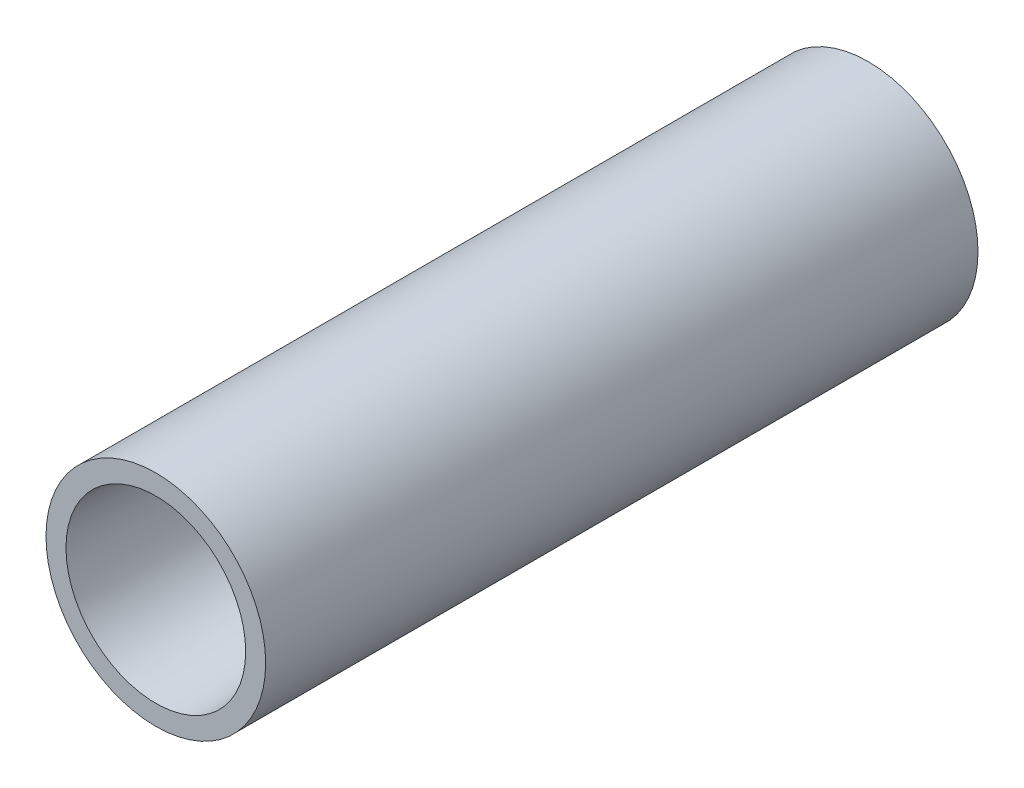
ISO-10303-21;
HEADER;
FILE_DESCRIPTION(('STEP AP214'),'2;1');
FILE_NAME('part.step','',(''),(''),'','','');
FILE_SCHEMA(('AUTOMOTIVE_DESIGN { 1 0 10303 214 1 1 1 1 }'));
ENDSEC;
DATA;
#1=APPLICATION_CONTEXT('core data for automotive mechanical design processes');
#2=APPLICATION_PROTOCOL_DEFINITION('international standard','automotive_design',2000,#1);
#3=PRODUCT_CONTEXT('',#1,'mechanical');
#4=PRODUCT('Part','Part','',(#3));
#5=PRODUCT_RELATED_PRODUCT_CATEGORY('part','',(#4));
#6=PRODUCT_DEFINITION_FORMATION('','',#4);
#7=PRODUCT_DEFINITION_CONTEXT('part definition',#1,'design');
#8=PRODUCT_DEFINITION('design','',#6,#7);
#9=PRODUCT_DEFINITION_SHAPE('','',#8);
#10=(LENGTH_UNIT() NAMED_UNIT(*) SI_UNIT(.MILLI.,.METRE.));
#11=(NAMED_UNIT(*) PLANE_ANGLE_UNIT() SI_UNIT($,.RADIAN.));
#12=(NAMED_UNIT(*) SI_UNIT($,.STERADIAN.) SOLID_ANGLE_UNIT());
#13=UNCERTAINTY_MEASURE_WITH_UNIT(LENGTH_MEASURE(1.E-05),#10,'distance_accuracy_value','');
#14=(GEOMETRIC_REPRESENTATION_CONTEXT(3) GLOBAL_UNCERTAINTY_ASSIGNED_CONTEXT((#13)) GLOBAL_UNIT_ASSIGNED_CONTEXT((#10,
#11,#12)) REPRESENTATION_CONTEXT('',''));
#15=CARTESIAN_POINT('',(0.,0.,0.));
#16=DIRECTION('',(0.,0.,1.));
#17=DIRECTION('',(1.,0.,0.));
#18=AXIS2_PLACEMENT_3D('',#15,#16,#17);
#19=CARTESIAN_POINT('',(0.,0.,18.));
#20=DIRECTION('',(0.,0.,-1.));
#21=DIRECTION('',(-1.,0.,0.));
#22=AXIS2_PLACEMENT_3D('',#19,#20,#21);
#23=CYLINDRICAL_SURFACE('',#22,1.);
#24=CARTESIAN_POINT('',(0.,0.,5.68));
#25=DIRECTION('',(0.,0.,1.));
#26=DIRECTION('',(1.,0.,0.));
#27=AXIS2_PLACEMENT_3D('',#24,#25,#26);
#28=CIRCLE('',#27,1.);
#29=CARTESIAN_POINT('',(1.,0.,5.68));
#30=VERTEX_POINT('',#29);
#31=EDGE_CURVE('E51',#30,#30,#28,.F.);
#32=ORIENTED_EDGE('',*,*,#31,.T.);
#33=EDGE_LOOP('',(#32));
#34=FACE_BOUND('',#33,.T.);
#35=CARTESIAN_POINT('',(0.,0.,12.32));
#36=DIRECTION('',(0.,0.,1.));
#37=DIRECTION('',(1.,0.,0.));
#38=AXIS2_PLACEMENT_3D('',#35,#36,#37);
#39=CIRCLE('',#38,1.);
#40=CARTESIAN_POINT('',(1.,0.,12.32));
#41=VERTEX_POINT('',#40);
#42=EDGE_CURVE('E38',#41,#41,#39,.T.);
#43=ORIENTED_EDGE('',*,*,#42,.T.);
#44=EDGE_LOOP('',(#43));
#45=FACE_BOUND('',#44,.T.);
#46=ADVANCED_FACE('F34',(#34,#45),#23,.F.);
#47=CARTESIAN_POINT('',(0.,0.,18.));
#48=DIRECTION('',(0.,0.,-1.));
#49=DIRECTION('',(-1.,0.,0.));
#50=AXIS2_PLACEMENT_3D('',#47,#48,#49);
#51=CYLINDRICAL_SURFACE('',#50,2.775);
#52=CARTESIAN_POINT('',(0.,0.,18.));
#53=DIRECTION('',(0.,0.,1.));
#54=DIRECTION('',(1.,0.,0.));
#55=AXIS2_PLACEMENT_3D('',#52,#53,#54);
#56=CIRCLE('',#55,2.775);
#57=CARTESIAN_POINT('',(2.775,0.,18.));
#58=VERTEX_POINT('',#57);
#59=EDGE_CURVE('E10',#58,#58,#56,.T.);
#60=ORIENTED_EDGE('',*,*,#59,.F.);
#61=EDGE_LOOP('',(#60));
#62=FACE_BOUND('',#61,.T.);
#63=CARTESIAN_POINT('',(0.,0.,0.));
#64=DIRECTION('',(0.,0.,1.));
#65=DIRECTION('',(1.,0.,0.));
#66=AXIS2_PLACEMENT_3D('',#63,#64,#65);
#67=CIRCLE('',#66,2.775);
#68=CARTESIAN_POINT('',(2.775,0.,0.));
#69=VERTEX_POINT('',#68);
#70=EDGE_CURVE('E42',#69,#69,#67,.T.);
#71=ORIENTED_EDGE('',*,*,#70,.T.);
#72=EDGE_LOOP('',(#71));
#73=FACE_BOUND('',#72,.T.);
#74=ADVANCED_FACE('F36',(#62,#73),#51,.T.);
#75=CARTESIAN_POINT('',(0.,0.,18.));
#76=DIRECTION('',(0.,0.,1.));
#77=DIRECTION('',(1.,0.,0.));
#78=AXIS2_PLACEMENT_3D('',#75,#76,#77);
#79=PLANE('',#78);
#80=CARTESIAN_POINT('',(0.,0.,18.));
#81=DIRECTION('',(0.,0.,1.));
#82=DIRECTION('',(1.,0.,0.));
#83=AXIS2_PLACEMENT_3D('',#80,#81,#82);
#84=CIRCLE('',#83,2.27);
#85=CARTESIAN_POINT('',(2.27,0.,18.));
#86=VERTEX_POINT('',#85);
#87=EDGE_CURVE('E62',#86,#86,#84,.T.);
#88=ORIENTED_EDGE('',*,*,#87,.F.);
#89=EDGE_LOOP('',(#88));
#90=FACE_BOUND('',#89,.T.);
#91=ORIENTED_EDGE('',*,*,#59,.T.);
#92=EDGE_LOOP('',(#91));
#93=FACE_BOUND('',#92,.T.);
#94=ADVANCED_FACE('F72',(#90,#93),#79,.T.);
#95=CARTESIAN_POINT('',(0.,0.,0.));
#96=DIRECTION('',(0.,0.,1.));
#97=DIRECTION('',(1.,0.,0.));
#98=AXIS2_PLACEMENT_3D('',#95,#96,#97);
#99=PLANE('',#98);
#100=CARTESIAN_POINT('',(0.,0.,0.));
#101=DIRECTION('',(0.,0.,1.));
#102=DIRECTION('',(1.,0.,0.));
#103=AXIS2_PLACEMENT_3D('',#100,#101,#102);
#104=CIRCLE('',#103,2.27);
#105=CARTESIAN_POINT('',(2.27,0.,0.));
#106=VERTEX_POINT('',#105);
#107=EDGE_CURVE('E53',#106,#106,#104,.T.);
#108=ORIENTED_EDGE('',*,*,#107,.T.);
#109=EDGE_LOOP('',(#108));
#110=FACE_BOUND('',#109,.T.);
#111=ORIENTED_EDGE('',*,*,#70,.F.);
#112=EDGE_LOOP('',(#111));
#113=FACE_BOUND('',#112,.T.);
#114=ADVANCED_FACE('F74',(#110,#113),#99,.F.);
#115=CARTESIAN_POINT('',(0.,0.,0.));
#116=DIRECTION('',(0.,0.,-1.));
#117=DIRECTION('',(1.,0.,0.));
#118=AXIS2_PLACEMENT_3D('',#115,#116,#117);
#119=CONICAL_SURFACE('',#118,2.27,0.0536514212063058);
#120=CARTESIAN_POINT('',(0.,0.,5.68));
#121=DIRECTION('',(0.,0.,1.));
#122=DIRECTION('',(1.,0.,0.));
#123=AXIS2_PLACEMENT_3D('',#120,#121,#122);
#124=CIRCLE('',#123,1.9649671949344);
#125=CARTESIAN_POINT('',(1.9649671949344,0.,5.68));
#126=VERTEX_POINT('',#125);
#127=EDGE_CURVE('E47',#126,#126,#124,.T.);
#128=ORIENTED_EDGE('',*,*,#127,.T.);
#129=EDGE_LOOP('',(#128));
#130=FACE_BOUND('',#129,.T.);
#131=ORIENTED_EDGE('',*,*,#107,.F.);
#132=EDGE_LOOP('',(#131));
#133=FACE_BOUND('',#132,.T.);
#134=ADVANCED_FACE('F80',(#130,#133),#119,.F.);
#135=CARTESIAN_POINT('',(0.,0.,5.68));
#136=DIRECTION('',(0.,0.,1.));
#137=DIRECTION('',(1.,0.,0.));
#138=AXIS2_PLACEMENT_3D('',#135,#136,#137);
#139=PLANE('',#138);
#140=ORIENTED_EDGE('',*,*,#31,.F.);
#141=EDGE_LOOP('',(#140));
#142=FACE_BOUND('',#141,.T.);
#143=ORIENTED_EDGE('',*,*,#127,.F.);
#144=EDGE_LOOP('',(#143));
#145=FACE_BOUND('',#144,.T.);
#146=ADVANCED_FACE('F91',(#142,#145),#139,.F.);
#147=CARTESIAN_POINT('',(0.,0.,18.));
#148=DIRECTION('',(0.,0.,1.));
#149=DIRECTION('',(1.,0.,0.));
#150=AXIS2_PLACEMENT_3D('',#147,#148,#149);
#151=CONICAL_SURFACE('',#150,2.27,0.0536514212063058);
#152=CARTESIAN_POINT('',(0.,0.,12.32));
#153=DIRECTION('',(0.,0.,1.));
#154=DIRECTION('',(1.,0.,0.));
#155=AXIS2_PLACEMENT_3D('',#152,#153,#154);
#156=CIRCLE('',#155,1.9649671949344);
#157=CARTESIAN_POINT('',(1.9649671949344,0.,12.32));
#158=VERTEX_POINT('',#157);
#159=EDGE_CURVE('E58',#158,#158,#156,.T.);
#160=ORIENTED_EDGE('',*,*,#159,.F.);
#161=EDGE_LOOP('',(#160));
#162=FACE_BOUND('',#161,.T.);
#163=ORIENTED_EDGE('',*,*,#87,.T.);
#164=EDGE_LOOP('',(#163));
#165=FACE_BOUND('',#164,.T.);
#166=ADVANCED_FACE('F70',(#162,#165),#151,.F.);
#167=CARTESIAN_POINT('',(0.,0.,12.32));
#168=DIRECTION('',(0.,0.,1.));
#169=DIRECTION('',(1.,0.,0.));
#170=AXIS2_PLACEMENT_3D('',#167,#168,#169);
#171=PLANE('',#170);
#172=ORIENTED_EDGE('',*,*,#42,.F.);
#173=EDGE_LOOP('',(#172));
#174=FACE_BOUND('',#173,.T.);
#175=ORIENTED_EDGE('',*,*,#159,.T.);
#176=EDGE_LOOP('',(#175));
#177=FACE_BOUND('',#176,.T.);
#178=ADVANCED_FACE('F118',(#174,#177),#171,.T.);
#179=CLOSED_SHELL('',(#46,#74,#94,#114,#134,#146,#166,#178));
#180=MANIFOLD_SOLID_BREP('B2',#179);
#181=ADVANCED_BREP_SHAPE_REPRESENTATION('',(#18,#180),#14);
#182=SHAPE_DEFINITION_REPRESENTATION(#9,#181);
ENDSEC;
END-ISO-10303-21;
